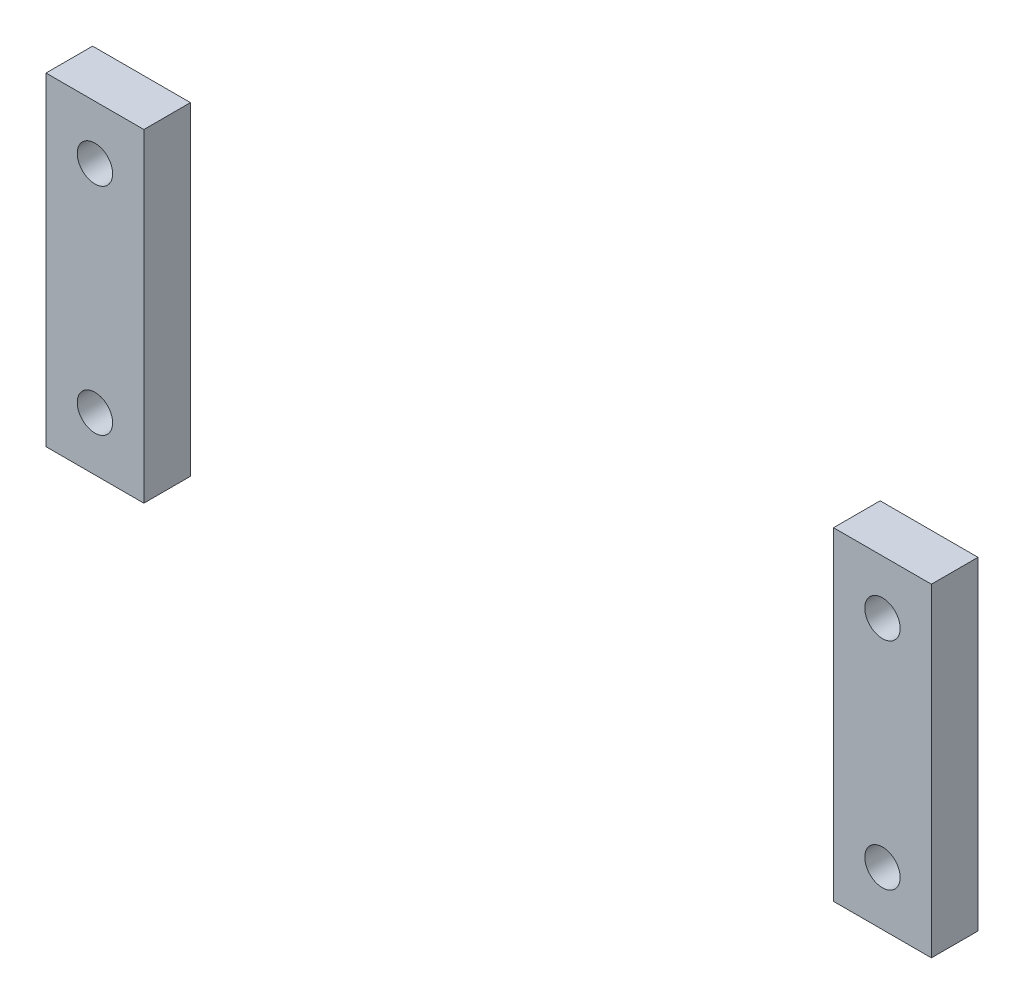
ISO-10303-21;
HEADER;
FILE_DESCRIPTION(('STEP AP214'),'2;1');
FILE_NAME('part.step','',(''),(''),'','','');
FILE_SCHEMA(('AUTOMOTIVE_DESIGN { 1 0 10303 214 1 1 1 1 }'));
ENDSEC;
DATA;
#1=APPLICATION_CONTEXT('core data for automotive mechanical design processes');
#2=APPLICATION_PROTOCOL_DEFINITION('international standard','automotive_design',2000,#1);
#3=PRODUCT_CONTEXT('',#1,'mechanical');
#4=PRODUCT('Part','Part','',(#3));
#5=PRODUCT_RELATED_PRODUCT_CATEGORY('part','',(#4));
#6=PRODUCT_DEFINITION_FORMATION('','',#4);
#7=PRODUCT_DEFINITION_CONTEXT('part definition',#1,'design');
#8=PRODUCT_DEFINITION('design','',#6,#7);
#9=PRODUCT_DEFINITION_SHAPE('','',#8);
#10=(LENGTH_UNIT() NAMED_UNIT(*) SI_UNIT(.MILLI.,.METRE.));
#11=(NAMED_UNIT(*) PLANE_ANGLE_UNIT() SI_UNIT($,.RADIAN.));
#12=(NAMED_UNIT(*) SI_UNIT($,.STERADIAN.) SOLID_ANGLE_UNIT());
#13=UNCERTAINTY_MEASURE_WITH_UNIT(LENGTH_MEASURE(1.E-05),#10,'distance_accuracy_value','');
#14=(GEOMETRIC_REPRESENTATION_CONTEXT(3) GLOBAL_UNCERTAINTY_ASSIGNED_CONTEXT((#13)) GLOBAL_UNIT_ASSIGNED_CONTEXT((#10,
#11,#12)) REPRESENTATION_CONTEXT('',''));
#15=CARTESIAN_POINT('',(0.,0.,0.));
#16=DIRECTION('',(0.,0.,1.));
#17=DIRECTION('',(1.,0.,0.));
#18=AXIS2_PLACEMENT_3D('',#15,#16,#17);
#19=CARTESIAN_POINT('',(0.,0.,8.));
#20=DIRECTION('',(0.,0.,-1.));
#21=DIRECTION('',(-1.,0.,0.));
#22=AXIS2_PLACEMENT_3D('',#19,#20,#21);
#23=PLANE('',#22);
#24=CARTESIAN_POINT('',(-42.25,11.575,8.));
#25=DIRECTION('',(0.,0.,1.));
#26=DIRECTION('',(1.,0.,0.));
#27=AXIS2_PLACEMENT_3D('',#24,#25,#26);
#28=CIRCLE('',#27,1.89864999999999);
#29=CARTESIAN_POINT('',(-40.35135,11.575,8.));
#30=VERTEX_POINT('',#29);
#31=EDGE_CURVE('E133',#30,#30,#28,.T.);
#32=ORIENTED_EDGE('',*,*,#31,.F.);
#33=EDGE_LOOP('',(#32));
#34=FACE_BOUND('',#33,.T.);
#35=DIRECTION('',(0.,-1.,0.));
#36=VECTOR('',#35,1.);
#37=CARTESIAN_POINT('',(-47.5,-17.3625,8.));
#38=LINE('',#37,#36);
#39=CARTESIAN_POINT('',(-47.5,17.3625,8.));
#40=VERTEX_POINT('',#39);
#41=CARTESIAN_POINT('',(-47.5,-17.3625,8.));
#42=VERTEX_POINT('',#41);
#43=EDGE_CURVE('E99',#40,#42,#38,.T.);
#44=ORIENTED_EDGE('',*,*,#43,.T.);
#45=DIRECTION('',(1.,0.,0.));
#46=VECTOR('',#45,1.);
#47=CARTESIAN_POINT('',(-47.5,-17.3625,8.));
#48=LINE('',#47,#46);
#49=CARTESIAN_POINT('',(-37.,-17.3625,8.));
#50=VERTEX_POINT('',#49);
#51=EDGE_CURVE('E94',#42,#50,#48,.T.);
#52=ORIENTED_EDGE('',*,*,#51,.T.);
#53=DIRECTION('',(0.,1.,0.));
#54=VECTOR('',#53,1.);
#55=CARTESIAN_POINT('',(-37.,17.3625,8.));
#56=LINE('',#55,#54);
#57=CARTESIAN_POINT('',(-37.,17.3625,8.));
#58=VERTEX_POINT('',#57);
#59=EDGE_CURVE('E97',#50,#58,#56,.T.);
#60=ORIENTED_EDGE('',*,*,#59,.T.);
#61=DIRECTION('',(-1.,0.,0.));
#62=VECTOR('',#61,1.);
#63=CARTESIAN_POINT('',(-47.5,17.3625,8.));
#64=LINE('',#63,#62);
#65=EDGE_CURVE('E64',#58,#40,#64,.T.);
#66=ORIENTED_EDGE('',*,*,#65,.T.);
#67=EDGE_LOOP('',(#44,#52,#60,#66));
#68=FACE_BOUND('',#67,.T.);
#69=CARTESIAN_POINT('',(-42.25,-11.575,8.));
#70=DIRECTION('',(0.,0.,1.));
#71=DIRECTION('',(1.,0.,0.));
#72=AXIS2_PLACEMENT_3D('',#69,#70,#71);
#73=CIRCLE('',#72,1.89864999999999);
#74=CARTESIAN_POINT('',(-40.35135,-11.575,8.));
#75=VERTEX_POINT('',#74);
#76=EDGE_CURVE('E127',#75,#75,#73,.T.);
#77=ORIENTED_EDGE('',*,*,#76,.F.);
#78=EDGE_LOOP('',(#77));
#79=FACE_BOUND('',#78,.T.);
#80=ADVANCED_FACE('F47',(#34,#68,#79),#23,.F.);
#81=CARTESIAN_POINT('',(-47.5,-17.3625,8.));
#82=DIRECTION('',(1.,0.,0.));
#83=DIRECTION('',(0.,1.,0.));
#84=AXIS2_PLACEMENT_3D('',#81,#82,#83);
#85=PLANE('',#84);
#86=DIRECTION('',(0.,-1.,0.));
#87=VECTOR('',#86,1.);
#88=CARTESIAN_POINT('',(-47.5,-17.3625,3.));
#89=LINE('',#88,#87);
#90=CARTESIAN_POINT('',(-47.5,17.3625,3.));
#91=VERTEX_POINT('',#90);
#92=CARTESIAN_POINT('',(-47.5,-17.3625,3.));
#93=VERTEX_POINT('',#92);
#94=EDGE_CURVE('E111',#91,#93,#89,.T.);
#95=ORIENTED_EDGE('',*,*,#94,.T.);
#96=DIRECTION('',(0.,0.,-1.));
#97=VECTOR('',#96,1.);
#98=CARTESIAN_POINT('',(-47.5,-17.3625,8.));
#99=LINE('',#98,#97);
#100=EDGE_CURVE('E12',#42,#93,#99,.T.);
#101=ORIENTED_EDGE('',*,*,#100,.F.);
#102=ORIENTED_EDGE('',*,*,#43,.F.);
#103=DIRECTION('',(0.,0.,-1.));
#104=VECTOR('',#103,1.);
#105=CARTESIAN_POINT('',(-47.5,17.3625,8.));
#106=LINE('',#105,#104);
#107=EDGE_CURVE('E107',#40,#91,#106,.T.);
#108=ORIENTED_EDGE('',*,*,#107,.T.);
#109=EDGE_LOOP('',(#95,#101,#102,#108));
#110=FACE_BOUND('',#109,.T.);
#111=ADVANCED_FACE('F49',(#110),#85,.F.);
#112=CARTESIAN_POINT('',(-47.5,-17.3625,8.));
#113=DIRECTION('',(0.,1.,0.));
#114=DIRECTION('',(-1.,0.,0.));
#115=AXIS2_PLACEMENT_3D('',#112,#113,#114);
#116=PLANE('',#115);
#117=DIRECTION('',(1.,0.,0.));
#118=VECTOR('',#117,1.);
#119=CARTESIAN_POINT('',(-47.5,-17.3625,3.));
#120=LINE('',#119,#118);
#121=CARTESIAN_POINT('',(-37.,-17.3625,3.));
#122=VERTEX_POINT('',#121);
#123=EDGE_CURVE('E103',#93,#122,#120,.T.);
#124=ORIENTED_EDGE('',*,*,#123,.T.);
#125=DIRECTION('',(0.,0.,-1.));
#126=VECTOR('',#125,1.);
#127=CARTESIAN_POINT('',(-37.,-17.3625,8.));
#128=LINE('',#127,#126);
#129=EDGE_CURVE('E56',#50,#122,#128,.T.);
#130=ORIENTED_EDGE('',*,*,#129,.F.);
#131=ORIENTED_EDGE('',*,*,#51,.F.);
#132=ORIENTED_EDGE('',*,*,#100,.T.);
#133=EDGE_LOOP('',(#124,#130,#131,#132));
#134=FACE_BOUND('',#133,.T.);
#135=ADVANCED_FACE('F102',(#134),#116,.F.);
#136=CARTESIAN_POINT('',(-37.,17.3625,8.));
#137=DIRECTION('',(-1.,0.,0.));
#138=DIRECTION('',(0.,-1.,0.));
#139=AXIS2_PLACEMENT_3D('',#136,#137,#138);
#140=PLANE('',#139);
#141=DIRECTION('',(0.,1.,0.));
#142=VECTOR('',#141,1.);
#143=CARTESIAN_POINT('',(-37.,17.3625,3.));
#144=LINE('',#143,#142);
#145=CARTESIAN_POINT('',(-37.,17.3625,3.));
#146=VERTEX_POINT('',#145);
#147=EDGE_CURVE('E81',#122,#146,#144,.T.);
#148=ORIENTED_EDGE('',*,*,#147,.T.);
#149=DIRECTION('',(0.,0.,-1.));
#150=VECTOR('',#149,1.);
#151=CARTESIAN_POINT('',(-37.,17.3625,8.));
#152=LINE('',#151,#150);
#153=EDGE_CURVE('E104',#58,#146,#152,.T.);
#154=ORIENTED_EDGE('',*,*,#153,.F.);
#155=ORIENTED_EDGE('',*,*,#59,.F.);
#156=ORIENTED_EDGE('',*,*,#129,.T.);
#157=EDGE_LOOP('',(#148,#154,#155,#156));
#158=FACE_BOUND('',#157,.T.);
#159=ADVANCED_FACE('F105',(#158),#140,.F.);
#160=CARTESIAN_POINT('',(-47.5,17.3625,8.));
#161=DIRECTION('',(0.,-1.,0.));
#162=DIRECTION('',(1.,0.,0.));
#163=AXIS2_PLACEMENT_3D('',#160,#161,#162);
#164=PLANE('',#163);
#165=DIRECTION('',(-1.,0.,0.));
#166=VECTOR('',#165,1.);
#167=CARTESIAN_POINT('',(-47.5,17.3625,3.));
#168=LINE('',#167,#166);
#169=EDGE_CURVE('E87',#146,#91,#168,.T.);
#170=ORIENTED_EDGE('',*,*,#169,.T.);
#171=ORIENTED_EDGE('',*,*,#107,.F.);
#172=ORIENTED_EDGE('',*,*,#65,.F.);
#173=ORIENTED_EDGE('',*,*,#153,.T.);
#174=EDGE_LOOP('',(#170,#171,#172,#173));
#175=FACE_BOUND('',#174,.T.);
#176=ADVANCED_FACE('F119',(#175),#164,.F.);
#177=CARTESIAN_POINT('',(0.,0.,3.));
#178=DIRECTION('',(0.,0.,-1.));
#179=DIRECTION('',(-1.,0.,0.));
#180=AXIS2_PLACEMENT_3D('',#177,#178,#179);
#181=PLANE('',#180);
#182=CARTESIAN_POINT('',(-42.25,11.575,3.));
#183=DIRECTION('',(0.,0.,1.));
#184=DIRECTION('',(1.,0.,0.));
#185=AXIS2_PLACEMENT_3D('',#182,#183,#184);
#186=CIRCLE('',#185,1.89864999999999);
#187=CARTESIAN_POINT('',(-40.35135,11.575,3.));
#188=VERTEX_POINT('',#187);
#189=EDGE_CURVE('E130',#188,#188,#186,.T.);
#190=ORIENTED_EDGE('',*,*,#189,.T.);
#191=EDGE_LOOP('',(#190));
#192=FACE_BOUND('',#191,.T.);
#193=CARTESIAN_POINT('',(-42.25,-11.575,3.));
#194=DIRECTION('',(0.,0.,1.));
#195=DIRECTION('',(1.,0.,0.));
#196=AXIS2_PLACEMENT_3D('',#193,#194,#195);
#197=CIRCLE('',#196,1.89864999999999);
#198=CARTESIAN_POINT('',(-40.35135,-11.575,3.));
#199=VERTEX_POINT('',#198);
#200=EDGE_CURVE('E114',#199,#199,#197,.T.);
#201=ORIENTED_EDGE('',*,*,#200,.T.);
#202=EDGE_LOOP('',(#201));
#203=FACE_BOUND('',#202,.T.);
#204=ORIENTED_EDGE('',*,*,#94,.F.);
#205=ORIENTED_EDGE('',*,*,#169,.F.);
#206=ORIENTED_EDGE('',*,*,#147,.F.);
#207=ORIENTED_EDGE('',*,*,#123,.F.);
#208=EDGE_LOOP('',(#204,#205,#206,#207));
#209=FACE_BOUND('',#208,.T.);
#210=ADVANCED_FACE('F122',(#192,#203,#209),#181,.T.);
#211=CARTESIAN_POINT('',(-42.25,-11.575,8.));
#212=DIRECTION('',(0.,0.,1.));
#213=DIRECTION('',(1.,0.,0.));
#214=AXIS2_PLACEMENT_3D('',#211,#212,#213);
#215=CYLINDRICAL_SURFACE('',#214,1.89864999999999);
#216=ORIENTED_EDGE('',*,*,#200,.F.);
#217=EDGE_LOOP('',(#216));
#218=FACE_BOUND('',#217,.T.);
#219=ORIENTED_EDGE('',*,*,#76,.T.);
#220=EDGE_LOOP('',(#219));
#221=FACE_BOUND('',#220,.T.);
#222=ADVANCED_FACE('F146',(#218,#221),#215,.F.);
#223=CARTESIAN_POINT('',(-42.25,11.575,8.));
#224=DIRECTION('',(0.,0.,1.));
#225=DIRECTION('',(1.,0.,0.));
#226=AXIS2_PLACEMENT_3D('',#223,#224,#225);
#227=CYLINDRICAL_SURFACE('',#226,1.89864999999999);
#228=ORIENTED_EDGE('',*,*,#189,.F.);
#229=EDGE_LOOP('',(#228));
#230=FACE_BOUND('',#229,.T.);
#231=ORIENTED_EDGE('',*,*,#31,.T.);
#232=EDGE_LOOP('',(#231));
#233=FACE_BOUND('',#232,.T.);
#234=ADVANCED_FACE('F137',(#230,#233),#227,.F.);
#235=CLOSED_SHELL('',(#80,#111,#135,#159,#176,#210,#222,#234));
#236=MANIFOLD_SOLID_BREP('B2',#235);
#237=CARTESIAN_POINT('',(47.5,-17.3625,8.));
#238=DIRECTION('',(0.,1.,0.));
#239=DIRECTION('',(-1.,0.,0.));
#240=AXIS2_PLACEMENT_3D('',#237,#238,#239);
#241=PLANE('',#240);
#242=DIRECTION('',(1.,0.,0.));
#243=VECTOR('',#242,1.);
#244=CARTESIAN_POINT('',(47.5,-17.3625,3.));
#245=LINE('',#244,#243);
#246=CARTESIAN_POINT('',(37.,-17.3625,3.));
#247=VERTEX_POINT('',#246);
#248=CARTESIAN_POINT('',(47.5,-17.3625,3.));
#249=VERTEX_POINT('',#248);
#250=EDGE_CURVE('E276',#247,#249,#245,.T.);
#251=ORIENTED_EDGE('',*,*,#250,.T.);
#252=DIRECTION('',(0.,0.,-1.));
#253=VECTOR('',#252,1.);
#254=CARTESIAN_POINT('',(47.5,-17.3625,8.));
#255=LINE('',#254,#253);
#256=CARTESIAN_POINT('',(47.5,-17.3625,8.));
#257=VERTEX_POINT('',#256);
#258=EDGE_CURVE('E45',#257,#249,#255,.T.);
#259=ORIENTED_EDGE('',*,*,#258,.F.);
#260=DIRECTION('',(1.,0.,0.));
#261=VECTOR('',#260,1.);
#262=CARTESIAN_POINT('',(47.5,-17.3625,8.));
#263=LINE('',#262,#261);
#264=CARTESIAN_POINT('',(37.,-17.3625,8.));
#265=VERTEX_POINT('',#264);
#266=EDGE_CURVE('E264',#265,#257,#263,.T.);
#267=ORIENTED_EDGE('',*,*,#266,.F.);
#268=DIRECTION('',(0.,0.,-1.));
#269=VECTOR('',#268,1.);
#270=CARTESIAN_POINT('',(37.,-17.3625,8.));
#271=LINE('',#270,#269);
#272=EDGE_CURVE('E272',#265,#247,#271,.T.);
#273=ORIENTED_EDGE('',*,*,#272,.T.);
#274=EDGE_LOOP('',(#251,#259,#267,#273));
#275=FACE_BOUND('',#274,.T.);
#276=ADVANCED_FACE('F213',(#275),#241,.F.);
#277=CARTESIAN_POINT('',(47.5,-17.3625,8.));
#278=DIRECTION('',(-1.,0.,0.));
#279=DIRECTION('',(0.,-1.,0.));
#280=AXIS2_PLACEMENT_3D('',#277,#278,#279);
#281=PLANE('',#280);
#282=DIRECTION('',(0.,1.,0.));
#283=VECTOR('',#282,1.);
#284=CARTESIAN_POINT('',(47.5,-17.3625,3.));
#285=LINE('',#284,#283);
#286=CARTESIAN_POINT('',(47.5,17.3625,3.));
#287=VERTEX_POINT('',#286);
#288=EDGE_CURVE('E268',#249,#287,#285,.T.);
#289=ORIENTED_EDGE('',*,*,#288,.T.);
#290=DIRECTION('',(0.,0.,-1.));
#291=VECTOR('',#290,1.);
#292=CARTESIAN_POINT('',(47.5,17.3625,8.));
#293=LINE('',#292,#291);
#294=CARTESIAN_POINT('',(47.5,17.3625,8.));
#295=VERTEX_POINT('',#294);
#296=EDGE_CURVE('E221',#295,#287,#293,.T.);
#297=ORIENTED_EDGE('',*,*,#296,.F.);
#298=DIRECTION('',(0.,1.,0.));
#299=VECTOR('',#298,1.);
#300=CARTESIAN_POINT('',(47.5,-17.3625,8.));
#301=LINE('',#300,#299);
#302=EDGE_CURVE('E259',#257,#295,#301,.T.);
#303=ORIENTED_EDGE('',*,*,#302,.F.);
#304=ORIENTED_EDGE('',*,*,#258,.T.);
#305=EDGE_LOOP('',(#289,#297,#303,#304));
#306=FACE_BOUND('',#305,.T.);
#307=ADVANCED_FACE('F267',(#306),#281,.F.);
#308=CARTESIAN_POINT('',(47.5,17.3625,8.));
#309=DIRECTION('',(0.,-1.,0.));
#310=DIRECTION('',(1.,0.,0.));
#311=AXIS2_PLACEMENT_3D('',#308,#309,#310);
#312=PLANE('',#311);
#313=DIRECTION('',(-1.,0.,0.));
#314=VECTOR('',#313,1.);
#315=CARTESIAN_POINT('',(47.5,17.3625,3.));
#316=LINE('',#315,#314);
#317=CARTESIAN_POINT('',(37.,17.3625,3.));
#318=VERTEX_POINT('',#317);
#319=EDGE_CURVE('E246',#287,#318,#316,.T.);
#320=ORIENTED_EDGE('',*,*,#319,.T.);
#321=DIRECTION('',(0.,0.,-1.));
#322=VECTOR('',#321,1.);
#323=CARTESIAN_POINT('',(37.,17.3625,8.));
#324=LINE('',#323,#322);
#325=CARTESIAN_POINT('',(37.,17.3625,8.));
#326=VERTEX_POINT('',#325);
#327=EDGE_CURVE('E269',#326,#318,#324,.T.);
#328=ORIENTED_EDGE('',*,*,#327,.F.);
#329=DIRECTION('',(-1.,0.,0.));
#330=VECTOR('',#329,1.);
#331=CARTESIAN_POINT('',(47.5,17.3625,8.));
#332=LINE('',#331,#330);
#333=EDGE_CURVE('E262',#295,#326,#332,.T.);
#334=ORIENTED_EDGE('',*,*,#333,.F.);
#335=ORIENTED_EDGE('',*,*,#296,.T.);
#336=EDGE_LOOP('',(#320,#328,#334,#335));
#337=FACE_BOUND('',#336,.T.);
#338=ADVANCED_FACE('F270',(#337),#312,.F.);
#339=CARTESIAN_POINT('',(37.,17.3625,8.));
#340=DIRECTION('',(1.,0.,0.));
#341=DIRECTION('',(0.,1.,0.));
#342=AXIS2_PLACEMENT_3D('',#339,#340,#341);
#343=PLANE('',#342);
#344=DIRECTION('',(0.,-1.,0.));
#345=VECTOR('',#344,1.);
#346=CARTESIAN_POINT('',(37.,17.3625,3.));
#347=LINE('',#346,#345);
#348=EDGE_CURVE('E252',#318,#247,#347,.T.);
#349=ORIENTED_EDGE('',*,*,#348,.T.);
#350=ORIENTED_EDGE('',*,*,#272,.F.);
#351=DIRECTION('',(0.,-1.,0.));
#352=VECTOR('',#351,1.);
#353=CARTESIAN_POINT('',(37.,17.3625,8.));
#354=LINE('',#353,#352);
#355=EDGE_CURVE('E229',#326,#265,#354,.T.);
#356=ORIENTED_EDGE('',*,*,#355,.F.);
#357=ORIENTED_EDGE('',*,*,#327,.T.);
#358=EDGE_LOOP('',(#349,#350,#356,#357));
#359=FACE_BOUND('',#358,.T.);
#360=ADVANCED_FACE('F284',(#359),#343,.F.);
#361=CARTESIAN_POINT('',(0.,0.,8.));
#362=DIRECTION('',(0.,0.,1.));
#363=DIRECTION('',(1.,0.,0.));
#364=AXIS2_PLACEMENT_3D('',#361,#362,#363);
#365=PLANE('',#364);
#366=CARTESIAN_POINT('',(42.25,11.575,8.));
#367=DIRECTION('',(0.,0.,1.));
#368=DIRECTION('',(1.,0.,0.));
#369=AXIS2_PLACEMENT_3D('',#366,#367,#368);
#370=CIRCLE('',#369,1.89864999999999);
#371=CARTESIAN_POINT('',(44.14865,11.575,8.));
#372=VERTEX_POINT('',#371);
#373=EDGE_CURVE('E298',#372,#372,#370,.T.);
#374=ORIENTED_EDGE('',*,*,#373,.F.);
#375=EDGE_LOOP('',(#374));
#376=FACE_BOUND('',#375,.T.);
#377=CARTESIAN_POINT('',(42.25,-11.575,8.));
#378=DIRECTION('',(0.,0.,1.));
#379=DIRECTION('',(1.,0.,0.));
#380=AXIS2_PLACEMENT_3D('',#377,#378,#379);
#381=CIRCLE('',#380,1.89864999999999);
#382=CARTESIAN_POINT('',(44.14865,-11.575,8.));
#383=VERTEX_POINT('',#382);
#384=EDGE_CURVE('E292',#383,#383,#381,.T.);
#385=ORIENTED_EDGE('',*,*,#384,.F.);
#386=EDGE_LOOP('',(#385));
#387=FACE_BOUND('',#386,.T.);
#388=ORIENTED_EDGE('',*,*,#266,.T.);
#389=ORIENTED_EDGE('',*,*,#302,.T.);
#390=ORIENTED_EDGE('',*,*,#333,.T.);
#391=ORIENTED_EDGE('',*,*,#355,.T.);
#392=EDGE_LOOP('',(#388,#389,#390,#391));
#393=FACE_BOUND('',#392,.T.);
#394=ADVANCED_FACE('F260',(#376,#387,#393),#365,.T.);
#395=CARTESIAN_POINT('',(0.,0.,3.));
#396=DIRECTION('',(0.,0.,1.));
#397=DIRECTION('',(1.,0.,0.));
#398=AXIS2_PLACEMENT_3D('',#395,#396,#397);
#399=PLANE('',#398);
#400=CARTESIAN_POINT('',(42.25,11.575,3.));
#401=DIRECTION('',(0.,0.,1.));
#402=DIRECTION('',(1.,0.,0.));
#403=AXIS2_PLACEMENT_3D('',#400,#401,#402);
#404=CIRCLE('',#403,1.89864999999999);
#405=CARTESIAN_POINT('',(44.14865,11.575,3.));
#406=VERTEX_POINT('',#405);
#407=EDGE_CURVE('E295',#406,#406,#404,.T.);
#408=ORIENTED_EDGE('',*,*,#407,.T.);
#409=EDGE_LOOP('',(#408));
#410=FACE_BOUND('',#409,.T.);
#411=CARTESIAN_POINT('',(42.25,-11.575,3.));
#412=DIRECTION('',(0.,0.,1.));
#413=DIRECTION('',(1.,0.,0.));
#414=AXIS2_PLACEMENT_3D('',#411,#412,#413);
#415=CIRCLE('',#414,1.89864999999999);
#416=CARTESIAN_POINT('',(44.14865,-11.575,3.));
#417=VERTEX_POINT('',#416);
#418=EDGE_CURVE('E279',#417,#417,#415,.T.);
#419=ORIENTED_EDGE('',*,*,#418,.T.);
#420=EDGE_LOOP('',(#419));
#421=FACE_BOUND('',#420,.T.);
#422=ORIENTED_EDGE('',*,*,#250,.F.);
#423=ORIENTED_EDGE('',*,*,#348,.F.);
#424=ORIENTED_EDGE('',*,*,#319,.F.);
#425=ORIENTED_EDGE('',*,*,#288,.F.);
#426=EDGE_LOOP('',(#422,#423,#424,#425));
#427=FACE_BOUND('',#426,.T.);
#428=ADVANCED_FACE('F287',(#410,#421,#427),#399,.F.);
#429=CARTESIAN_POINT('',(42.25,-11.575,8.));
#430=DIRECTION('',(0.,0.,1.));
#431=DIRECTION('',(1.,0.,0.));
#432=AXIS2_PLACEMENT_3D('',#429,#430,#431);
#433=CYLINDRICAL_SURFACE('',#432,1.89864999999999);
#434=ORIENTED_EDGE('',*,*,#418,.F.);
#435=EDGE_LOOP('',(#434));
#436=FACE_BOUND('',#435,.T.);
#437=ORIENTED_EDGE('',*,*,#384,.T.);
#438=EDGE_LOOP('',(#437));
#439=FACE_BOUND('',#438,.T.);
#440=ADVANCED_FACE('F309',(#436,#439),#433,.F.);
#441=CARTESIAN_POINT('',(42.25,11.575,8.));
#442=DIRECTION('',(0.,0.,1.));
#443=DIRECTION('',(1.,0.,0.));
#444=AXIS2_PLACEMENT_3D('',#441,#442,#443);
#445=CYLINDRICAL_SURFACE('',#444,1.89864999999999);
#446=ORIENTED_EDGE('',*,*,#407,.F.);
#447=EDGE_LOOP('',(#446));
#448=FACE_BOUND('',#447,.T.);
#449=ORIENTED_EDGE('',*,*,#373,.T.);
#450=EDGE_LOOP('',(#449));
#451=FACE_BOUND('',#450,.T.);
#452=ADVANCED_FACE('F302',(#448,#451),#445,.F.);
#453=CLOSED_SHELL('',(#276,#307,#338,#360,#394,#428,#440,#452));
#454=MANIFOLD_SOLID_BREP('B6',#453);
#455=ADVANCED_BREP_SHAPE_REPRESENTATION('',(#18,#236,#454),#14);
#456=SHAPE_DEFINITION_REPRESENTATION(#9,#455);
ENDSEC;
END-ISO-10303-21;
